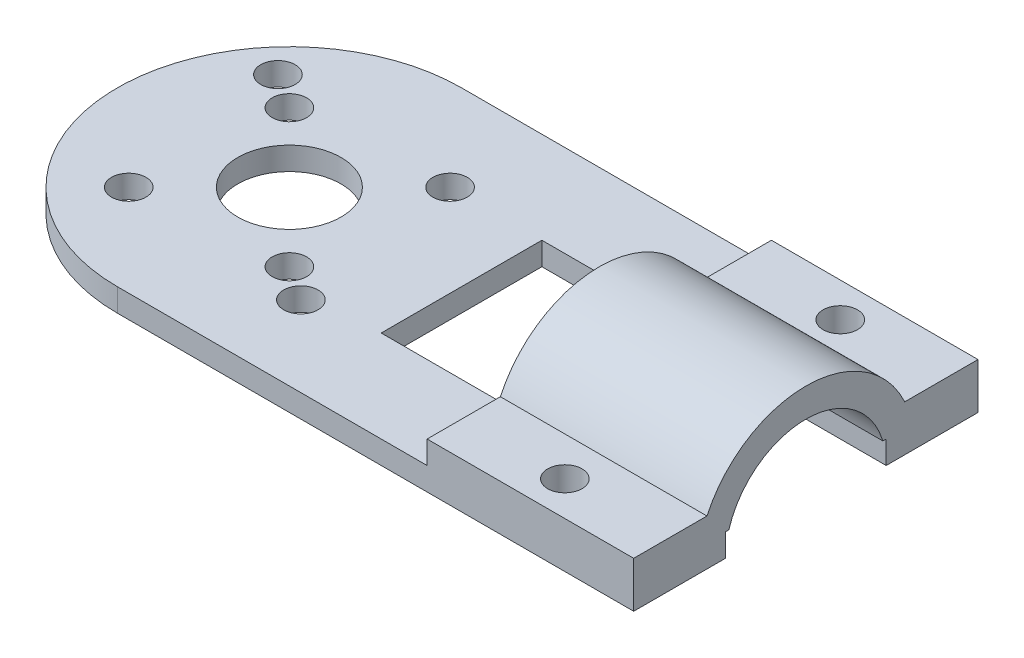
ISO-10303-21;
HEADER;
FILE_DESCRIPTION(('STEP AP214'),'2;1');
FILE_NAME('part.step','',(''),(''),'','','');
FILE_SCHEMA(('AUTOMOTIVE_DESIGN { 1 0 10303 214 1 1 1 1 }'));
ENDSEC;
DATA;
#1=APPLICATION_CONTEXT('core data for automotive mechanical design processes');
#2=APPLICATION_PROTOCOL_DEFINITION('international standard','automotive_design',2000,#1);
#3=PRODUCT_CONTEXT('',#1,'mechanical');
#4=PRODUCT('Part','Part','',(#3));
#5=PRODUCT_RELATED_PRODUCT_CATEGORY('part','',(#4));
#6=PRODUCT_DEFINITION_FORMATION('','',#4);
#7=PRODUCT_DEFINITION_CONTEXT('part definition',#1,'design');
#8=PRODUCT_DEFINITION('design','',#6,#7);
#9=PRODUCT_DEFINITION_SHAPE('','',#8);
#10=(LENGTH_UNIT() NAMED_UNIT(*) SI_UNIT(.MILLI.,.METRE.));
#11=(NAMED_UNIT(*) PLANE_ANGLE_UNIT() SI_UNIT($,.RADIAN.));
#12=(NAMED_UNIT(*) SI_UNIT($,.STERADIAN.) SOLID_ANGLE_UNIT());
#13=UNCERTAINTY_MEASURE_WITH_UNIT(LENGTH_MEASURE(1.E-05),#10,'distance_accuracy_value','');
#14=(GEOMETRIC_REPRESENTATION_CONTEXT(3) GLOBAL_UNCERTAINTY_ASSIGNED_CONTEXT((#13)) GLOBAL_UNIT_ASSIGNED_CONTEXT((#10,
#11,#12)) REPRESENTATION_CONTEXT('',''));
#15=CARTESIAN_POINT('',(0.,0.,0.));
#16=DIRECTION('',(0.,0.,1.));
#17=DIRECTION('',(1.,0.,0.));
#18=AXIS2_PLACEMENT_3D('',#15,#16,#17);
#19=CARTESIAN_POINT('',(12.,2.,-15.));
#20=DIRECTION('',(0.,-1.,0.));
#21=DIRECTION('',(0.,0.,-1.));
#22=AXIS2_PLACEMENT_3D('',#19,#20,#21);
#23=PLANE('',#22);
#24=DIRECTION('',(1.,0.,0.));
#25=VECTOR('',#24,1.);
#26=CARTESIAN_POINT('',(12.,2.,-6.70820393249938));
#27=LINE('',#26,#25);
#28=CARTESIAN_POINT('',(12.,2.,-6.70820393249938));
#29=VERTEX_POINT('',#28);
#30=CARTESIAN_POINT('',(30.,2.,-6.7082039324994));
#31=VERTEX_POINT('',#30);
#32=EDGE_CURVE('E140',#29,#31,#27,.T.);
#33=ORIENTED_EDGE('',*,*,#32,.F.);
#34=DIRECTION('',(0.,0.,-1.));
#35=VECTOR('',#34,1.);
#36=CARTESIAN_POINT('',(12.,2.,-15.));
#37=LINE('',#36,#35);
#38=CARTESIAN_POINT('',(12.,2.,-7.00000000000001));
#39=VERTEX_POINT('',#38);
#40=EDGE_CURVE('E146',#29,#39,#37,.T.);
#41=ORIENTED_EDGE('',*,*,#40,.T.);
#42=DIRECTION('',(1.,0.,0.));
#43=VECTOR('',#42,1.);
#44=CARTESIAN_POINT('',(30.,2.,-7.00000000000002));
#45=LINE('',#44,#43);
#46=CARTESIAN_POINT('',(30.,2.,-7.00000000000001));
#47=VERTEX_POINT('',#46);
#48=EDGE_CURVE('E199',#39,#47,#45,.T.);
#49=ORIENTED_EDGE('',*,*,#48,.T.);
#50=DIRECTION('',(0.,0.,-1.));
#51=VECTOR('',#50,1.);
#52=CARTESIAN_POINT('',(30.,2.,-15.));
#53=LINE('',#52,#51);
#54=EDGE_CURVE('E37',#31,#47,#53,.T.);
#55=ORIENTED_EDGE('',*,*,#54,.F.);
#56=EDGE_LOOP('',(#33,#41,#49,#55));
#57=FACE_BOUND('',#56,.T.);
#58=ADVANCED_FACE('F33',(#57),#23,.T.);
#59=CARTESIAN_POINT('',(-15.,2.,0.));
#60=DIRECTION('',(0.,1.,0.));
#61=DIRECTION('',(0.,0.,1.));
#62=AXIS2_PLACEMENT_3D('',#59,#60,#61);
#63=PLANE('',#62);
#64=CARTESIAN_POINT('',(-24.,2.,-8.00000000000001));
#65=DIRECTION('',(0.,1.,0.));
#66=DIRECTION('',(0.,0.,1.));
#67=AXIS2_PLACEMENT_3D('',#64,#65,#66);
#68=CIRCLE('',#67,1.5);
#69=CARTESIAN_POINT('',(-24.,2.,-6.50000000000001));
#70=VERTEX_POINT('',#69);
#71=EDGE_CURVE('E291',#70,#70,#68,.T.);
#72=ORIENTED_EDGE('',*,*,#71,.F.);
#73=EDGE_LOOP('',(#72));
#74=FACE_BOUND('',#73,.T.);
#75=CARTESIAN_POINT('',(-22.,2.,6.99999999999999));
#76=DIRECTION('',(0.,1.,0.));
#77=DIRECTION('',(0.,0.,1.));
#78=AXIS2_PLACEMENT_3D('',#75,#76,#77);
#79=CIRCLE('',#78,1.5);
#80=CARTESIAN_POINT('',(-22.,2.,8.49999999999999));
#81=VERTEX_POINT('',#80);
#82=EDGE_CURVE('E303',#81,#81,#79,.T.);
#83=ORIENTED_EDGE('',*,*,#82,.F.);
#84=EDGE_LOOP('',(#83));
#85=FACE_BOUND('',#84,.T.);
#86=CARTESIAN_POINT('',(-8.99999999999999,2.,5.99999999999999));
#87=DIRECTION('',(0.,1.,0.));
#88=DIRECTION('',(0.,0.,1.));
#89=AXIS2_PLACEMENT_3D('',#86,#87,#88);
#90=CIRCLE('',#89,1.5);
#91=CARTESIAN_POINT('',(-8.99999999999999,2.,7.49999999999999));
#92=VERTEX_POINT('',#91);
#93=EDGE_CURVE('E315',#92,#92,#90,.T.);
#94=ORIENTED_EDGE('',*,*,#93,.F.);
#95=EDGE_LOOP('',(#94));
#96=FACE_BOUND('',#95,.T.);
#97=CARTESIAN_POINT('',(-15.,2.,0.));
#98=DIRECTION('',(0.,1.,0.));
#99=DIRECTION('',(0.,0.,1.));
#100=AXIS2_PLACEMENT_3D('',#97,#98,#99);
#101=CIRCLE('',#100,4.5);
#102=CARTESIAN_POINT('',(-15.,2.,4.49999999999999));
#103=VERTEX_POINT('',#102);
#104=EDGE_CURVE('E319',#103,#103,#101,.T.);
#105=ORIENTED_EDGE('',*,*,#104,.F.);
#106=EDGE_LOOP('',(#105));
#107=FACE_BOUND('',#106,.T.);
#108=CARTESIAN_POINT('',(-6.,2.,7.99999999999999));
#109=DIRECTION('',(0.,1.,0.));
#110=DIRECTION('',(0.,0.,1.));
#111=AXIS2_PLACEMENT_3D('',#108,#109,#110);
#112=CIRCLE('',#111,1.5);
#113=CARTESIAN_POINT('',(-6.,2.,9.49999999999999));
#114=VERTEX_POINT('',#113);
#115=EDGE_CURVE('E309',#114,#114,#112,.T.);
#116=ORIENTED_EDGE('',*,*,#115,.F.);
#117=EDGE_LOOP('',(#116));
#118=FACE_BOUND('',#117,.T.);
#119=CARTESIAN_POINT('',(-21.,2.,-6.00000000000001));
#120=DIRECTION('',(0.,1.,0.));
#121=DIRECTION('',(0.,0.,1.));
#122=AXIS2_PLACEMENT_3D('',#119,#120,#121);
#123=CIRCLE('',#122,1.5);
#124=CARTESIAN_POINT('',(-21.,2.,-4.50000000000001));
#125=VERTEX_POINT('',#124);
#126=EDGE_CURVE('E297',#125,#125,#123,.T.);
#127=ORIENTED_EDGE('',*,*,#126,.F.);
#128=EDGE_LOOP('',(#127));
#129=FACE_BOUND('',#128,.T.);
#130=CARTESIAN_POINT('',(-8.,2.,-7.00000000000001));
#131=DIRECTION('',(0.,1.,0.));
#132=DIRECTION('',(0.,0.,1.));
#133=AXIS2_PLACEMENT_3D('',#130,#131,#132);
#134=CIRCLE('',#133,1.5);
#135=CARTESIAN_POINT('',(-8.,2.,-5.50000000000001));
#136=VERTEX_POINT('',#135);
#137=EDGE_CURVE('E284',#136,#136,#134,.T.);
#138=ORIENTED_EDGE('',*,*,#137,.F.);
#139=EDGE_LOOP('',(#138));
#140=FACE_BOUND('',#139,.T.);
#141=DIRECTION('',(1.,0.,0.));
#142=VECTOR('',#141,1.);
#143=CARTESIAN_POINT('',(-15.,2.,15.));
#144=LINE('',#143,#142);
#145=CARTESIAN_POINT('',(-15.,2.,15.));
#146=VERTEX_POINT('',#145);
#147=CARTESIAN_POINT('',(12.,2.,15.));
#148=VERTEX_POINT('',#147);
#149=EDGE_CURVE('E195',#146,#148,#144,.T.);
#150=ORIENTED_EDGE('',*,*,#149,.T.);
#151=CARTESIAN_POINT('',(12.,2.,7.));
#152=VERTEX_POINT('',#151);
#153=EDGE_CURVE('E154',#148,#152,#37,.T.);
#154=ORIENTED_EDGE('',*,*,#153,.T.);
#155=DIRECTION('',(-1.,0.,0.));
#156=VECTOR('',#155,1.);
#157=CARTESIAN_POINT('',(30.,2.,7.));
#158=LINE('',#157,#156);
#159=CARTESIAN_POINT('',(0.,2.,7.));
#160=VERTEX_POINT('',#159);
#161=EDGE_CURVE('E191',#152,#160,#158,.T.);
#162=ORIENTED_EDGE('',*,*,#161,.T.);
#163=DIRECTION('',(0.,0.,-1.));
#164=VECTOR('',#163,1.);
#165=CARTESIAN_POINT('',(0.,2.,-7.));
#166=LINE('',#165,#164);
#167=CARTESIAN_POINT('',(0.,2.,-7.));
#168=VERTEX_POINT('',#167);
#169=EDGE_CURVE('E190',#160,#168,#166,.T.);
#170=ORIENTED_EDGE('',*,*,#169,.T.);
#171=EDGE_CURVE('E200',#168,#39,#45,.T.);
#172=ORIENTED_EDGE('',*,*,#171,.T.);
#173=CARTESIAN_POINT('',(12.,2.,-15.));
#174=VERTEX_POINT('',#173);
#175=EDGE_CURVE('E43',#39,#174,#37,.T.);
#176=ORIENTED_EDGE('',*,*,#175,.T.);
#177=DIRECTION('',(-1.,0.,0.));
#178=VECTOR('',#177,1.);
#179=CARTESIAN_POINT('',(-15.,2.,-15.));
#180=LINE('',#179,#178);
#181=CARTESIAN_POINT('',(-15.,2.,-15.));
#182=VERTEX_POINT('',#181);
#183=EDGE_CURVE('E238',#174,#182,#180,.T.);
#184=ORIENTED_EDGE('',*,*,#183,.T.);
#185=CARTESIAN_POINT('',(-15.,2.,0.));
#186=DIRECTION('',(0.,1.,0.));
#187=DIRECTION('',(0.,0.,1.));
#188=AXIS2_PLACEMENT_3D('',#185,#186,#187);
#189=CIRCLE('',#188,15.);
#190=EDGE_CURVE('E240',#182,#146,#189,.T.);
#191=ORIENTED_EDGE('',*,*,#190,.T.);
#192=EDGE_LOOP('',(#150,#154,#162,#170,#172,#176,#184,#191));
#193=FACE_BOUND('',#192,.T.);
#194=ADVANCED_FACE('F250',(#74,#85,#96,#107,#118,#129,#140,#193),#63,.T.);
#195=CARTESIAN_POINT('',(-15.,0.,0.));
#196=DIRECTION('',(0.,1.,0.));
#197=DIRECTION('',(0.,0.,1.));
#198=AXIS2_PLACEMENT_3D('',#195,#196,#197);
#199=PLANE('',#198);
#200=CARTESIAN_POINT('',(21.,0.,12.));
#201=DIRECTION('',(0.,1.,0.));
#202=DIRECTION('',(0.,0.,1.));
#203=AXIS2_PLACEMENT_3D('',#200,#201,#202);
#204=CIRCLE('',#203,1.5);
#205=CARTESIAN_POINT('',(21.,0.,13.5));
#206=VERTEX_POINT('',#205);
#207=EDGE_CURVE('E431',#206,#206,#204,.T.);
#208=ORIENTED_EDGE('',*,*,#207,.T.);
#209=EDGE_LOOP('',(#208));
#210=FACE_BOUND('',#209,.T.);
#211=CARTESIAN_POINT('',(21.,0.,-12.));
#212=DIRECTION('',(0.,1.,0.));
#213=DIRECTION('',(0.,0.,1.));
#214=AXIS2_PLACEMENT_3D('',#211,#212,#213);
#215=CIRCLE('',#214,1.5);
#216=CARTESIAN_POINT('',(21.,0.,-10.5));
#217=VERTEX_POINT('',#216);
#218=EDGE_CURVE('E436',#217,#217,#215,.T.);
#219=ORIENTED_EDGE('',*,*,#218,.T.);
#220=EDGE_LOOP('',(#219));
#221=FACE_BOUND('',#220,.T.);
#222=CARTESIAN_POINT('',(-24.,0.,-8.00000000000001));
#223=DIRECTION('',(0.,1.,0.));
#224=DIRECTION('',(0.,0.,1.));
#225=AXIS2_PLACEMENT_3D('',#222,#223,#224);
#226=CIRCLE('',#225,1.5);
#227=CARTESIAN_POINT('',(-24.,0.,-6.50000000000001));
#228=VERTEX_POINT('',#227);
#229=EDGE_CURVE('E287',#228,#228,#226,.T.);
#230=ORIENTED_EDGE('',*,*,#229,.T.);
#231=EDGE_LOOP('',(#230));
#232=FACE_BOUND('',#231,.T.);
#233=CARTESIAN_POINT('',(-22.,0.,6.99999999999999));
#234=DIRECTION('',(0.,1.,0.));
#235=DIRECTION('',(0.,0.,1.));
#236=AXIS2_PLACEMENT_3D('',#233,#234,#235);
#237=CIRCLE('',#236,1.5);
#238=CARTESIAN_POINT('',(-22.,0.,8.49999999999999));
#239=VERTEX_POINT('',#238);
#240=EDGE_CURVE('E300',#239,#239,#237,.T.);
#241=ORIENTED_EDGE('',*,*,#240,.T.);
#242=EDGE_LOOP('',(#241));
#243=FACE_BOUND('',#242,.T.);
#244=CARTESIAN_POINT('',(-8.99999999999999,0.,5.99999999999999));
#245=DIRECTION('',(0.,1.,0.));
#246=DIRECTION('',(0.,0.,1.));
#247=AXIS2_PLACEMENT_3D('',#244,#245,#246);
#248=CIRCLE('',#247,1.5);
#249=CARTESIAN_POINT('',(-8.99999999999999,0.,7.49999999999999));
#250=VERTEX_POINT('',#249);
#251=EDGE_CURVE('E312',#250,#250,#248,.T.);
#252=ORIENTED_EDGE('',*,*,#251,.T.);
#253=EDGE_LOOP('',(#252));
#254=FACE_BOUND('',#253,.T.);
#255=DIRECTION('',(-1.,0.,0.));
#256=VECTOR('',#255,1.);
#257=CARTESIAN_POINT('',(-15.,0.,-15.));
#258=LINE('',#257,#256);
#259=CARTESIAN_POINT('',(30.,0.,-15.));
#260=VERTEX_POINT('',#259);
#261=CARTESIAN_POINT('',(-15.,0.,-15.));
#262=VERTEX_POINT('',#261);
#263=EDGE_CURVE('E205',#260,#262,#258,.T.);
#264=ORIENTED_EDGE('',*,*,#263,.F.);
#265=DIRECTION('',(0.,0.,-1.));
#266=VECTOR('',#265,1.);
#267=CARTESIAN_POINT('',(30.,0.,-15.));
#268=LINE('',#267,#266);
#269=CARTESIAN_POINT('',(30.,0.,-7.00000000000002));
#270=VERTEX_POINT('',#269);
#271=EDGE_CURVE('E225',#270,#260,#268,.T.);
#272=ORIENTED_EDGE('',*,*,#271,.F.);
#273=DIRECTION('',(1.,0.,0.));
#274=VECTOR('',#273,1.);
#275=CARTESIAN_POINT('',(30.,0.,-7.00000000000002));
#276=LINE('',#275,#274);
#277=CARTESIAN_POINT('',(0.,0.,-7.));
#278=VERTEX_POINT('',#277);
#279=EDGE_CURVE('E384',#278,#270,#276,.T.);
#280=ORIENTED_EDGE('',*,*,#279,.F.);
#281=DIRECTION('',(0.,0.,-1.));
#282=VECTOR('',#281,1.);
#283=CARTESIAN_POINT('',(0.,0.,-7.));
#284=LINE('',#283,#282);
#285=CARTESIAN_POINT('',(0.,0.,7.));
#286=VERTEX_POINT('',#285);
#287=EDGE_CURVE('E381',#286,#278,#284,.T.);
#288=ORIENTED_EDGE('',*,*,#287,.F.);
#289=DIRECTION('',(-1.,0.,0.));
#290=VECTOR('',#289,1.);
#291=CARTESIAN_POINT('',(30.,0.,7.));
#292=LINE('',#291,#290);
#293=CARTESIAN_POINT('',(30.,0.,7.));
#294=VERTEX_POINT('',#293);
#295=EDGE_CURVE('E386',#294,#286,#292,.T.);
#296=ORIENTED_EDGE('',*,*,#295,.F.);
#297=DIRECTION('',(0.,0.,-1.));
#298=VECTOR('',#297,1.);
#299=CARTESIAN_POINT('',(30.,0.,7.));
#300=LINE('',#299,#298);
#301=CARTESIAN_POINT('',(30.,0.,15.));
#302=VERTEX_POINT('',#301);
#303=EDGE_CURVE('E370',#302,#294,#300,.T.);
#304=ORIENTED_EDGE('',*,*,#303,.F.);
#305=DIRECTION('',(1.,0.,0.));
#306=VECTOR('',#305,1.);
#307=CARTESIAN_POINT('',(-15.,0.,15.));
#308=LINE('',#307,#306);
#309=CARTESIAN_POINT('',(-15.,0.,15.));
#310=VERTEX_POINT('',#309);
#311=EDGE_CURVE('E391',#310,#302,#308,.T.);
#312=ORIENTED_EDGE('',*,*,#311,.F.);
#313=CARTESIAN_POINT('',(-15.,0.,0.));
#314=DIRECTION('',(0.,1.,0.));
#315=DIRECTION('',(0.,0.,1.));
#316=AXIS2_PLACEMENT_3D('',#313,#314,#315);
#317=CIRCLE('',#316,15.);
#318=EDGE_CURVE('E323',#262,#310,#317,.T.);
#319=ORIENTED_EDGE('',*,*,#318,.F.);
#320=EDGE_LOOP('',(#264,#272,#280,#288,#296,#304,#312,#319));
#321=FACE_BOUND('',#320,.T.);
#322=CARTESIAN_POINT('',(-15.,0.,0.));
#323=DIRECTION('',(0.,1.,0.));
#324=DIRECTION('',(0.,0.,1.));
#325=AXIS2_PLACEMENT_3D('',#322,#323,#324);
#326=CIRCLE('',#325,4.5);
#327=CARTESIAN_POINT('',(-15.,0.,4.49999999999999));
#328=VERTEX_POINT('',#327);
#329=EDGE_CURVE('E243',#328,#328,#326,.T.);
#330=ORIENTED_EDGE('',*,*,#329,.T.);
#331=EDGE_LOOP('',(#330));
#332=FACE_BOUND('',#331,.T.);
#333=CARTESIAN_POINT('',(-6.,0.,7.99999999999999));
#334=DIRECTION('',(0.,1.,0.));
#335=DIRECTION('',(0.,0.,1.));
#336=AXIS2_PLACEMENT_3D('',#333,#334,#335);
#337=CIRCLE('',#336,1.5);
#338=CARTESIAN_POINT('',(-6.,0.,9.49999999999999));
#339=VERTEX_POINT('',#338);
#340=EDGE_CURVE('E306',#339,#339,#337,.T.);
#341=ORIENTED_EDGE('',*,*,#340,.T.);
#342=EDGE_LOOP('',(#341));
#343=FACE_BOUND('',#342,.T.);
#344=CARTESIAN_POINT('',(-21.,0.,-6.00000000000001));
#345=DIRECTION('',(0.,1.,0.));
#346=DIRECTION('',(0.,0.,1.));
#347=AXIS2_PLACEMENT_3D('',#344,#345,#346);
#348=CIRCLE('',#347,1.5);
#349=CARTESIAN_POINT('',(-21.,0.,-4.50000000000001));
#350=VERTEX_POINT('',#349);
#351=EDGE_CURVE('E294',#350,#350,#348,.T.);
#352=ORIENTED_EDGE('',*,*,#351,.T.);
#353=EDGE_LOOP('',(#352));
#354=FACE_BOUND('',#353,.T.);
#355=CARTESIAN_POINT('',(-8.,0.,-7.00000000000001));
#356=DIRECTION('',(0.,1.,0.));
#357=DIRECTION('',(0.,0.,1.));
#358=AXIS2_PLACEMENT_3D('',#355,#356,#357);
#359=CIRCLE('',#358,1.5);
#360=CARTESIAN_POINT('',(-8.,0.,-5.50000000000001));
#361=VERTEX_POINT('',#360);
#362=EDGE_CURVE('E288',#361,#361,#359,.T.);
#363=ORIENTED_EDGE('',*,*,#362,.T.);
#364=EDGE_LOOP('',(#363));
#365=FACE_BOUND('',#364,.T.);
#366=ADVANCED_FACE('F327',(#210,#221,#232,#243,#254,#321,#332,#343,#354,#365),#199,.F.);
#367=CARTESIAN_POINT('',(-15.,2.,-15.));
#368=DIRECTION('',(0.,0.,1.));
#369=DIRECTION('',(1.,0.,0.));
#370=AXIS2_PLACEMENT_3D('',#367,#368,#369);
#371=PLANE('',#370);
#372=ORIENTED_EDGE('',*,*,#263,.T.);
#373=DIRECTION('',(0.,-1.,0.));
#374=VECTOR('',#373,1.);
#375=CARTESIAN_POINT('',(-15.,2.,-15.));
#376=LINE('',#375,#374);
#377=EDGE_CURVE('E235',#182,#262,#376,.T.);
#378=ORIENTED_EDGE('',*,*,#377,.F.);
#379=ORIENTED_EDGE('',*,*,#183,.F.);
#380=DIRECTION('',(0.,1.,0.));
#381=VECTOR('',#380,1.);
#382=CARTESIAN_POINT('',(12.,4.,-15.));
#383=LINE('',#382,#381);
#384=CARTESIAN_POINT('',(12.,4.,-15.));
#385=VERTEX_POINT('',#384);
#386=EDGE_CURVE('E171',#174,#385,#383,.T.);
#387=ORIENTED_EDGE('',*,*,#386,.T.);
#388=DIRECTION('',(1.,0.,0.));
#389=VECTOR('',#388,1.);
#390=CARTESIAN_POINT('',(12.,4.,-15.));
#391=LINE('',#390,#389);
#392=CARTESIAN_POINT('',(30.,4.,-15.));
#393=VERTEX_POINT('',#392);
#394=EDGE_CURVE('E177',#385,#393,#391,.T.);
#395=ORIENTED_EDGE('',*,*,#394,.T.);
#396=DIRECTION('',(0.,-1.,0.));
#397=VECTOR('',#396,1.);
#398=CARTESIAN_POINT('',(30.,2.,-15.));
#399=LINE('',#398,#397);
#400=EDGE_CURVE('E204',#393,#260,#399,.T.);
#401=ORIENTED_EDGE('',*,*,#400,.T.);
#402=EDGE_LOOP('',(#372,#378,#379,#387,#395,#401));
#403=FACE_BOUND('',#402,.T.);
#404=ADVANCED_FACE('F35',(#403),#371,.F.);
#405=CARTESIAN_POINT('',(-15.,2.,0.));
#406=DIRECTION('',(0.,-1.,0.));
#407=DIRECTION('',(0.,0.,-1.));
#408=AXIS2_PLACEMENT_3D('',#405,#406,#407);
#409=CYLINDRICAL_SURFACE('',#408,15.);
#410=ORIENTED_EDGE('',*,*,#318,.T.);
#411=DIRECTION('',(0.,-1.,0.));
#412=VECTOR('',#411,1.);
#413=CARTESIAN_POINT('',(-15.,2.,15.));
#414=LINE('',#413,#412);
#415=EDGE_CURVE('E232',#146,#310,#414,.T.);
#416=ORIENTED_EDGE('',*,*,#415,.F.);
#417=ORIENTED_EDGE('',*,*,#190,.F.);
#418=ORIENTED_EDGE('',*,*,#377,.T.);
#419=EDGE_LOOP('',(#410,#416,#417,#418));
#420=FACE_BOUND('',#419,.T.);
#421=ADVANCED_FACE('F393',(#420),#409,.T.);
#422=CARTESIAN_POINT('',(-15.,2.,15.));
#423=DIRECTION('',(0.,0.,-1.));
#424=DIRECTION('',(-1.,0.,0.));
#425=AXIS2_PLACEMENT_3D('',#422,#423,#424);
#426=PLANE('',#425);
#427=ORIENTED_EDGE('',*,*,#311,.T.);
#428=DIRECTION('',(0.,-1.,0.));
#429=VECTOR('',#428,1.);
#430=CARTESIAN_POINT('',(30.,2.,15.));
#431=LINE('',#430,#429);
#432=CARTESIAN_POINT('',(30.,4.,15.));
#433=VERTEX_POINT('',#432);
#434=EDGE_CURVE('E184',#433,#302,#431,.T.);
#435=ORIENTED_EDGE('',*,*,#434,.F.);
#436=DIRECTION('',(1.,0.,0.));
#437=VECTOR('',#436,1.);
#438=CARTESIAN_POINT('',(12.,4.,15.));
#439=LINE('',#438,#437);
#440=CARTESIAN_POINT('',(12.,4.,15.));
#441=VERTEX_POINT('',#440);
#442=EDGE_CURVE('E257',#441,#433,#439,.T.);
#443=ORIENTED_EDGE('',*,*,#442,.F.);
#444=DIRECTION('',(0.,-1.,0.));
#445=VECTOR('',#444,1.);
#446=CARTESIAN_POINT('',(12.,2.,15.));
#447=LINE('',#446,#445);
#448=EDGE_CURVE('E174',#441,#148,#447,.T.);
#449=ORIENTED_EDGE('',*,*,#448,.T.);
#450=ORIENTED_EDGE('',*,*,#149,.F.);
#451=ORIENTED_EDGE('',*,*,#415,.T.);
#452=EDGE_LOOP('',(#427,#435,#443,#449,#450,#451));
#453=FACE_BOUND('',#452,.T.);
#454=ADVANCED_FACE('F253',(#453),#426,.F.);
#455=CARTESIAN_POINT('',(30.,2.,7.));
#456=DIRECTION('',(0.,0.,1.));
#457=DIRECTION('',(1.,0.,0.));
#458=AXIS2_PLACEMENT_3D('',#455,#456,#457);
#459=PLANE('',#458);
#460=ORIENTED_EDGE('',*,*,#295,.T.);
#461=DIRECTION('',(0.,-1.,0.));
#462=VECTOR('',#461,1.);
#463=CARTESIAN_POINT('',(0.,2.,7.));
#464=LINE('',#463,#462);
#465=EDGE_CURVE('E185',#160,#286,#464,.T.);
#466=ORIENTED_EDGE('',*,*,#465,.F.);
#467=ORIENTED_EDGE('',*,*,#161,.F.);
#468=CARTESIAN_POINT('',(30.,2.,7.));
#469=VERTEX_POINT('',#468);
#470=EDGE_CURVE('E188',#469,#152,#158,.T.);
#471=ORIENTED_EDGE('',*,*,#470,.F.);
#472=DIRECTION('',(0.,-1.,0.));
#473=VECTOR('',#472,1.);
#474=CARTESIAN_POINT('',(30.,2.,7.));
#475=LINE('',#474,#473);
#476=EDGE_CURVE('E181',#469,#294,#475,.T.);
#477=ORIENTED_EDGE('',*,*,#476,.T.);
#478=EDGE_LOOP('',(#460,#466,#467,#471,#477));
#479=FACE_BOUND('',#478,.T.);
#480=ADVANCED_FACE('F373',(#479),#459,.F.);
#481=CARTESIAN_POINT('',(0.,2.,-7.));
#482=DIRECTION('',(-1.,0.,0.));
#483=DIRECTION('',(0.,0.,1.));
#484=AXIS2_PLACEMENT_3D('',#481,#482,#483);
#485=PLANE('',#484);
#486=ORIENTED_EDGE('',*,*,#287,.T.);
#487=DIRECTION('',(0.,-1.,0.));
#488=VECTOR('',#487,1.);
#489=CARTESIAN_POINT('',(0.,2.,-7.));
#490=LINE('',#489,#488);
#491=EDGE_CURVE('E212',#168,#278,#490,.T.);
#492=ORIENTED_EDGE('',*,*,#491,.F.);
#493=ORIENTED_EDGE('',*,*,#169,.F.);
#494=ORIENTED_EDGE('',*,*,#465,.T.);
#495=EDGE_LOOP('',(#486,#492,#493,#494));
#496=FACE_BOUND('',#495,.T.);
#497=ADVANCED_FACE('F379',(#496),#485,.F.);
#498=CARTESIAN_POINT('',(30.,2.,-7.00000000000002));
#499=DIRECTION('',(0.,0.,-1.));
#500=DIRECTION('',(-1.,0.,0.));
#501=AXIS2_PLACEMENT_3D('',#498,#499,#500);
#502=PLANE('',#501);
#503=ORIENTED_EDGE('',*,*,#279,.T.);
#504=DIRECTION('',(0.,-1.,0.));
#505=VECTOR('',#504,1.);
#506=CARTESIAN_POINT('',(30.,2.,-7.00000000000002));
#507=LINE('',#506,#505);
#508=EDGE_CURVE('E210',#47,#270,#507,.T.);
#509=ORIENTED_EDGE('',*,*,#508,.F.);
#510=ORIENTED_EDGE('',*,*,#48,.F.);
#511=ORIENTED_EDGE('',*,*,#171,.F.);
#512=ORIENTED_EDGE('',*,*,#491,.T.);
#513=EDGE_LOOP('',(#503,#509,#510,#511,#512));
#514=FACE_BOUND('',#513,.T.);
#515=ADVANCED_FACE('F342',(#514),#502,.F.);
#516=CARTESIAN_POINT('',(30.,2.,-15.));
#517=DIRECTION('',(-1.,0.,0.));
#518=DIRECTION('',(0.,0.,1.));
#519=AXIS2_PLACEMENT_3D('',#516,#517,#518);
#520=PLANE('',#519);
#521=CARTESIAN_POINT('',(30.,2.,6.70820393249934));
#522=VERTEX_POINT('',#521);
#523=EDGE_CURVE('E279',#469,#522,#53,.T.);
#524=ORIENTED_EDGE('',*,*,#523,.T.);
#525=CARTESIAN_POINT('',(30.,0.,0.));
#526=DIRECTION('',(1.,0.,0.));
#527=DIRECTION('',(0.,0.,-1.));
#528=AXIS2_PLACEMENT_3D('',#525,#526,#527);
#529=CIRCLE('',#528,7.);
#530=EDGE_CURVE('E367',#31,#522,#529,.T.);
#531=ORIENTED_EDGE('',*,*,#530,.F.);
#532=ORIENTED_EDGE('',*,*,#54,.T.);
#533=ORIENTED_EDGE('',*,*,#508,.T.);
#534=ORIENTED_EDGE('',*,*,#271,.T.);
#535=ORIENTED_EDGE('',*,*,#400,.F.);
#536=DIRECTION('',(0.,0.,1.));
#537=VECTOR('',#536,1.);
#538=CARTESIAN_POINT('',(30.,4.,-8.61684396980704));
#539=LINE('',#538,#537);
#540=CARTESIAN_POINT('',(30.,4.,-8.61684396980704));
#541=VERTEX_POINT('',#540);
#542=EDGE_CURVE('E275',#393,#541,#539,.T.);
#543=ORIENTED_EDGE('',*,*,#542,.T.);
#544=CARTESIAN_POINT('',(30.,0.,0.));
#545=DIRECTION('',(1.,0.,0.));
#546=DIRECTION('',(0.,0.,-1.));
#547=AXIS2_PLACEMENT_3D('',#544,#545,#546);
#548=CIRCLE('',#547,9.5);
#549=CARTESIAN_POINT('',(30.,4.,8.61684396980704));
#550=VERTEX_POINT('',#549);
#551=EDGE_CURVE('E156',#541,#550,#548,.T.);
#552=ORIENTED_EDGE('',*,*,#551,.T.);
#553=DIRECTION('',(0.,0.,1.));
#554=VECTOR('',#553,1.);
#555=CARTESIAN_POINT('',(30.,4.,15.));
#556=LINE('',#555,#554);
#557=EDGE_CURVE('E152',#550,#433,#556,.T.);
#558=ORIENTED_EDGE('',*,*,#557,.T.);
#559=ORIENTED_EDGE('',*,*,#434,.T.);
#560=ORIENTED_EDGE('',*,*,#303,.T.);
#561=ORIENTED_EDGE('',*,*,#476,.F.);
#562=EDGE_LOOP('',(#524,#531,#532,#533,#534,#535,#543,#552,#558,#559,#560,#561));
#563=FACE_BOUND('',#562,.T.);
#564=ADVANCED_FACE('F333',(#563),#520,.F.);
#565=CARTESIAN_POINT('',(-15.,2.,0.));
#566=DIRECTION('',(0.,-1.,0.));
#567=DIRECTION('',(0.,0.,-1.));
#568=AXIS2_PLACEMENT_3D('',#565,#566,#567);
#569=CYLINDRICAL_SURFACE('',#568,4.5);
#570=ORIENTED_EDGE('',*,*,#104,.T.);
#571=EDGE_LOOP('',(#570));
#572=FACE_BOUND('',#571,.T.);
#573=ORIENTED_EDGE('',*,*,#329,.F.);
#574=EDGE_LOOP('',(#573));
#575=FACE_BOUND('',#574,.T.);
#576=ADVANCED_FACE('F330',(#572,#575),#569,.F.);
#577=CARTESIAN_POINT('',(-8.99999999999999,2.,5.99999999999999));
#578=DIRECTION('',(0.,-1.,0.));
#579=DIRECTION('',(0.,0.,-1.));
#580=AXIS2_PLACEMENT_3D('',#577,#578,#579);
#581=CYLINDRICAL_SURFACE('',#580,1.5);
#582=ORIENTED_EDGE('',*,*,#93,.T.);
#583=EDGE_LOOP('',(#582));
#584=FACE_BOUND('',#583,.T.);
#585=ORIENTED_EDGE('',*,*,#251,.F.);
#586=EDGE_LOOP('',(#585));
#587=FACE_BOUND('',#586,.T.);
#588=ADVANCED_FACE('F332',(#584,#587),#581,.F.);
#589=CARTESIAN_POINT('',(-6.,2.,7.99999999999999));
#590=DIRECTION('',(0.,-1.,0.));
#591=DIRECTION('',(0.,0.,-1.));
#592=AXIS2_PLACEMENT_3D('',#589,#590,#591);
#593=CYLINDRICAL_SURFACE('',#592,1.5);
#594=ORIENTED_EDGE('',*,*,#115,.T.);
#595=EDGE_LOOP('',(#594));
#596=FACE_BOUND('',#595,.T.);
#597=ORIENTED_EDGE('',*,*,#340,.F.);
#598=EDGE_LOOP('',(#597));
#599=FACE_BOUND('',#598,.T.);
#600=ADVANCED_FACE('F339',(#596,#599),#593,.F.);
#601=CARTESIAN_POINT('',(-22.,2.,6.99999999999999));
#602=DIRECTION('',(0.,-1.,0.));
#603=DIRECTION('',(0.,0.,-1.));
#604=AXIS2_PLACEMENT_3D('',#601,#602,#603);
#605=CYLINDRICAL_SURFACE('',#604,1.5);
#606=ORIENTED_EDGE('',*,*,#82,.T.);
#607=EDGE_LOOP('',(#606));
#608=FACE_BOUND('',#607,.T.);
#609=ORIENTED_EDGE('',*,*,#240,.F.);
#610=EDGE_LOOP('',(#609));
#611=FACE_BOUND('',#610,.T.);
#612=ADVANCED_FACE('F455',(#608,#611),#605,.F.);
#613=CARTESIAN_POINT('',(-21.,2.,-6.00000000000001));
#614=DIRECTION('',(0.,-1.,0.));
#615=DIRECTION('',(0.,0.,-1.));
#616=AXIS2_PLACEMENT_3D('',#613,#614,#615);
#617=CYLINDRICAL_SURFACE('',#616,1.5);
#618=ORIENTED_EDGE('',*,*,#126,.T.);
#619=EDGE_LOOP('',(#618));
#620=FACE_BOUND('',#619,.T.);
#621=ORIENTED_EDGE('',*,*,#351,.F.);
#622=EDGE_LOOP('',(#621));
#623=FACE_BOUND('',#622,.T.);
#624=ADVANCED_FACE('F457',(#620,#623),#617,.F.);
#625=CARTESIAN_POINT('',(-24.,2.,-8.00000000000001));
#626=DIRECTION('',(0.,-1.,0.));
#627=DIRECTION('',(0.,0.,-1.));
#628=AXIS2_PLACEMENT_3D('',#625,#626,#627);
#629=CYLINDRICAL_SURFACE('',#628,1.5);
#630=ORIENTED_EDGE('',*,*,#71,.T.);
#631=EDGE_LOOP('',(#630));
#632=FACE_BOUND('',#631,.T.);
#633=ORIENTED_EDGE('',*,*,#229,.F.);
#634=EDGE_LOOP('',(#633));
#635=FACE_BOUND('',#634,.T.);
#636=ADVANCED_FACE('F364',(#632,#635),#629,.F.);
#637=CARTESIAN_POINT('',(-8.,2.,-7.00000000000001));
#638=DIRECTION('',(0.,-1.,0.));
#639=DIRECTION('',(0.,0.,-1.));
#640=AXIS2_PLACEMENT_3D('',#637,#638,#639);
#641=CYLINDRICAL_SURFACE('',#640,1.5);
#642=ORIENTED_EDGE('',*,*,#137,.T.);
#643=EDGE_LOOP('',(#642));
#644=FACE_BOUND('',#643,.T.);
#645=ORIENTED_EDGE('',*,*,#362,.F.);
#646=EDGE_LOOP('',(#645));
#647=FACE_BOUND('',#646,.T.);
#648=ADVANCED_FACE('F356',(#644,#647),#641,.F.);
#649=DIRECTION('',(1.,0.,0.));
#650=VECTOR('',#649,1.);
#651=CARTESIAN_POINT('',(12.,2.,6.70820393249936));
#652=LINE('',#651,#650);
#653=CARTESIAN_POINT('',(12.,2.,6.70820393249936));
#654=VERTEX_POINT('',#653);
#655=EDGE_CURVE('E50',#522,#654,#652,.F.);
#656=ORIENTED_EDGE('',*,*,#655,.F.);
#657=ORIENTED_EDGE('',*,*,#523,.F.);
#658=ORIENTED_EDGE('',*,*,#470,.T.);
#659=EDGE_CURVE('E56',#152,#654,#37,.T.);
#660=ORIENTED_EDGE('',*,*,#659,.T.);
#661=EDGE_LOOP('',(#656,#657,#658,#660));
#662=FACE_BOUND('',#661,.T.);
#663=ADVANCED_FACE('F347',(#662),#23,.T.);
#664=CARTESIAN_POINT('',(12.,4.,15.));
#665=DIRECTION('',(0.,1.,0.));
#666=DIRECTION('',(0.,0.,1.));
#667=AXIS2_PLACEMENT_3D('',#664,#665,#666);
#668=PLANE('',#667);
#669=CARTESIAN_POINT('',(21.,4.,12.));
#670=DIRECTION('',(0.,1.,0.));
#671=DIRECTION('',(0.,0.,1.));
#672=AXIS2_PLACEMENT_3D('',#669,#670,#671);
#673=CIRCLE('',#672,1.5);
#674=CARTESIAN_POINT('',(21.,4.,13.5));
#675=VERTEX_POINT('',#674);
#676=EDGE_CURVE('E428',#675,#675,#673,.T.);
#677=ORIENTED_EDGE('',*,*,#676,.F.);
#678=EDGE_LOOP('',(#677));
#679=FACE_BOUND('',#678,.T.);
#680=ORIENTED_EDGE('',*,*,#557,.F.);
#681=DIRECTION('',(1.,0.,0.));
#682=VECTOR('',#681,1.);
#683=CARTESIAN_POINT('',(12.,4.,8.61684396980704));
#684=LINE('',#683,#682);
#685=CARTESIAN_POINT('',(12.,4.,8.61684396980704));
#686=VERTEX_POINT('',#685);
#687=EDGE_CURVE('E270',#686,#550,#684,.T.);
#688=ORIENTED_EDGE('',*,*,#687,.F.);
#689=DIRECTION('',(0.,0.,1.));
#690=VECTOR('',#689,1.);
#691=CARTESIAN_POINT('',(12.,4.,15.));
#692=LINE('',#691,#690);
#693=EDGE_CURVE('E178',#686,#441,#692,.T.);
#694=ORIENTED_EDGE('',*,*,#693,.T.);
#695=ORIENTED_EDGE('',*,*,#442,.T.);
#696=EDGE_LOOP('',(#680,#688,#694,#695));
#697=FACE_BOUND('',#696,.T.);
#698=ADVANCED_FACE('F355',(#679,#697),#668,.T.);
#699=CARTESIAN_POINT('',(12.,0.,0.));
#700=DIRECTION('',(1.,0.,0.));
#701=DIRECTION('',(0.,0.,-1.));
#702=AXIS2_PLACEMENT_3D('',#699,#700,#701);
#703=CYLINDRICAL_SURFACE('',#702,9.5);
#704=ORIENTED_EDGE('',*,*,#551,.F.);
#705=DIRECTION('',(1.,0.,0.));
#706=VECTOR('',#705,1.);
#707=CARTESIAN_POINT('',(12.,4.,-8.61684396980704));
#708=LINE('',#707,#706);
#709=CARTESIAN_POINT('',(12.,4.,-8.61684396980704));
#710=VERTEX_POINT('',#709);
#711=EDGE_CURVE('E272',#710,#541,#708,.T.);
#712=ORIENTED_EDGE('',*,*,#711,.F.);
#713=CARTESIAN_POINT('',(12.,0.,0.));
#714=DIRECTION('',(1.,0.,0.));
#715=DIRECTION('',(0.,0.,-1.));
#716=AXIS2_PLACEMENT_3D('',#713,#714,#715);
#717=CIRCLE('',#716,9.5);
#718=EDGE_CURVE('E263',#710,#686,#717,.T.);
#719=ORIENTED_EDGE('',*,*,#718,.T.);
#720=ORIENTED_EDGE('',*,*,#687,.T.);
#721=EDGE_LOOP('',(#704,#712,#719,#720));
#722=FACE_BOUND('',#721,.T.);
#723=ADVANCED_FACE('F269',(#722),#703,.T.);
#724=CARTESIAN_POINT('',(12.,4.,-8.61684396980704));
#725=DIRECTION('',(0.,1.,0.));
#726=DIRECTION('',(0.,0.,1.));
#727=AXIS2_PLACEMENT_3D('',#724,#725,#726);
#728=PLANE('',#727);
#729=CARTESIAN_POINT('',(21.,4.,-12.));
#730=DIRECTION('',(0.,1.,0.));
#731=DIRECTION('',(0.,0.,1.));
#732=AXIS2_PLACEMENT_3D('',#729,#730,#731);
#733=CIRCLE('',#732,1.5);
#734=CARTESIAN_POINT('',(21.,4.,-10.5));
#735=VERTEX_POINT('',#734);
#736=EDGE_CURVE('E433',#735,#735,#733,.T.);
#737=ORIENTED_EDGE('',*,*,#736,.F.);
#738=EDGE_LOOP('',(#737));
#739=FACE_BOUND('',#738,.T.);
#740=ORIENTED_EDGE('',*,*,#542,.F.);
#741=ORIENTED_EDGE('',*,*,#394,.F.);
#742=DIRECTION('',(0.,0.,1.));
#743=VECTOR('',#742,1.);
#744=CARTESIAN_POINT('',(12.,4.,-8.61684396980704));
#745=LINE('',#744,#743);
#746=EDGE_CURVE('E161',#385,#710,#745,.T.);
#747=ORIENTED_EDGE('',*,*,#746,.T.);
#748=ORIENTED_EDGE('',*,*,#711,.T.);
#749=EDGE_LOOP('',(#740,#741,#747,#748));
#750=FACE_BOUND('',#749,.T.);
#751=ADVANCED_FACE('F403',(#739,#750),#728,.T.);
#752=CARTESIAN_POINT('',(12.,0.,0.));
#753=DIRECTION('',(1.,0.,0.));
#754=DIRECTION('',(0.,0.,-1.));
#755=AXIS2_PLACEMENT_3D('',#752,#753,#754);
#756=PLANE('',#755);
#757=ORIENTED_EDGE('',*,*,#40,.F.);
#758=CARTESIAN_POINT('',(12.,0.,0.));
#759=DIRECTION('',(1.,0.,0.));
#760=DIRECTION('',(0.,0.,-1.));
#761=AXIS2_PLACEMENT_3D('',#758,#759,#760);
#762=CIRCLE('',#761,7.);
#763=EDGE_CURVE('E11',#29,#654,#762,.T.);
#764=ORIENTED_EDGE('',*,*,#763,.T.);
#765=ORIENTED_EDGE('',*,*,#659,.F.);
#766=ORIENTED_EDGE('',*,*,#153,.F.);
#767=ORIENTED_EDGE('',*,*,#448,.F.);
#768=ORIENTED_EDGE('',*,*,#693,.F.);
#769=ORIENTED_EDGE('',*,*,#718,.F.);
#770=ORIENTED_EDGE('',*,*,#746,.F.);
#771=ORIENTED_EDGE('',*,*,#386,.F.);
#772=ORIENTED_EDGE('',*,*,#175,.F.);
#773=EDGE_LOOP('',(#757,#764,#765,#766,#767,#768,#769,#770,#771,#772));
#774=FACE_BOUND('',#773,.T.);
#775=ADVANCED_FACE('F149',(#774),#756,.F.);
#776=CARTESIAN_POINT('',(12.,0.,0.));
#777=DIRECTION('',(1.,0.,0.));
#778=DIRECTION('',(0.,0.,-1.));
#779=AXIS2_PLACEMENT_3D('',#776,#777,#778);
#780=CYLINDRICAL_SURFACE('',#779,7.);
#781=ORIENTED_EDGE('',*,*,#32,.T.);
#782=ORIENTED_EDGE('',*,*,#530,.T.);
#783=ORIENTED_EDGE('',*,*,#655,.T.);
#784=ORIENTED_EDGE('',*,*,#763,.F.);
#785=EDGE_LOOP('',(#781,#782,#783,#784));
#786=FACE_BOUND('',#785,.T.);
#787=ADVANCED_FACE('F139',(#786),#780,.F.);
#788=CARTESIAN_POINT('',(21.,-13.,-12.));
#789=DIRECTION('',(0.,1.,0.));
#790=DIRECTION('',(0.,0.,1.));
#791=AXIS2_PLACEMENT_3D('',#788,#789,#790);
#792=CYLINDRICAL_SURFACE('',#791,1.5);
#793=ORIENTED_EDGE('',*,*,#736,.T.);
#794=EDGE_LOOP('',(#793));
#795=FACE_BOUND('',#794,.T.);
#796=ORIENTED_EDGE('',*,*,#218,.F.);
#797=EDGE_LOOP('',(#796));
#798=FACE_BOUND('',#797,.T.);
#799=ADVANCED_FACE('F416',(#795,#798),#792,.F.);
#800=CARTESIAN_POINT('',(21.,-13.,12.));
#801=DIRECTION('',(0.,1.,0.));
#802=DIRECTION('',(0.,0.,1.));
#803=AXIS2_PLACEMENT_3D('',#800,#801,#802);
#804=CYLINDRICAL_SURFACE('',#803,1.5);
#805=ORIENTED_EDGE('',*,*,#676,.T.);
#806=EDGE_LOOP('',(#805));
#807=FACE_BOUND('',#806,.T.);
#808=ORIENTED_EDGE('',*,*,#207,.F.);
#809=EDGE_LOOP('',(#808));
#810=FACE_BOUND('',#809,.T.);
#811=ADVANCED_FACE('F419',(#807,#810),#804,.F.);
#812=CLOSED_SHELL('',(#58,#194,#366,#404,#421,#454,#480,#497,#515,#564,#576,#588,#600,#612,#624,
#636,#648,#663,#698,#723,#751,#775,#787,#799,#811));
#813=MANIFOLD_SOLID_BREP('B2',#812);
#814=ADVANCED_BREP_SHAPE_REPRESENTATION('',(#18,#813),#14);
#815=SHAPE_DEFINITION_REPRESENTATION(#9,#814);
ENDSEC;
END-ISO-10303-21;
